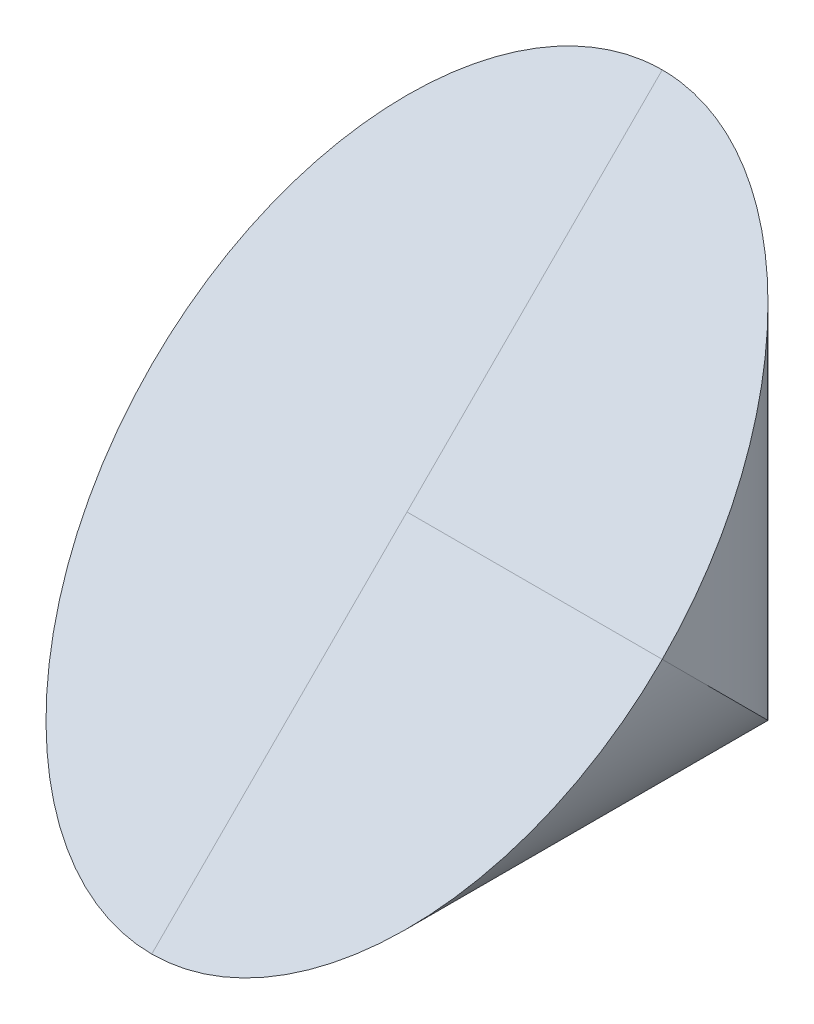
ISO-10303-21;
HEADER;
FILE_DESCRIPTION(('STEP AP214'),'2;1');
FILE_NAME('part.step','',(''),(''),'','','');
FILE_SCHEMA(('AUTOMOTIVE_DESIGN { 1 0 10303 214 1 1 1 1 }'));
ENDSEC;
DATA;
#1=APPLICATION_CONTEXT('core data for automotive mechanical design processes');
#2=APPLICATION_PROTOCOL_DEFINITION('international standard','automotive_design',2000,#1);
#3=PRODUCT_CONTEXT('',#1,'mechanical');
#4=PRODUCT('Part','Part','',(#3));
#5=PRODUCT_RELATED_PRODUCT_CATEGORY('part','',(#4));
#6=PRODUCT_DEFINITION_FORMATION('','',#4);
#7=PRODUCT_DEFINITION_CONTEXT('part definition',#1,'design');
#8=PRODUCT_DEFINITION('design','',#6,#7);
#9=PRODUCT_DEFINITION_SHAPE('','',#8);
#10=(LENGTH_UNIT() NAMED_UNIT(*) SI_UNIT(.MILLI.,.METRE.));
#11=(NAMED_UNIT(*) PLANE_ANGLE_UNIT() SI_UNIT($,.RADIAN.));
#12=(NAMED_UNIT(*) SI_UNIT($,.STERADIAN.) SOLID_ANGLE_UNIT());
#13=UNCERTAINTY_MEASURE_WITH_UNIT(LENGTH_MEASURE(1.E-05),#10,'distance_accuracy_value','');
#14=(GEOMETRIC_REPRESENTATION_CONTEXT(3) GLOBAL_UNCERTAINTY_ASSIGNED_CONTEXT((#13)) GLOBAL_UNIT_ASSIGNED_CONTEXT((#10,
#11,#12)) REPRESENTATION_CONTEXT('',''));
#15=CARTESIAN_POINT('',(0.,0.,0.));
#16=DIRECTION('',(0.,0.,1.));
#17=DIRECTION('',(1.,0.,0.));
#18=AXIS2_PLACEMENT_3D('',#15,#16,#17);
#19=CARTESIAN_POINT('',(60.,30.,0.));
#20=DIRECTION('',(0.,0.707106781186547,0.707106781186547));
#21=DIRECTION('',(0.,-0.707106781186548,0.707106781186548));
#22=AXIS2_PLACEMENT_3D('',#19,#20,#21);
#23=PLANE('',#22);
#24=CARTESIAN_POINT('',(0.,0.,30.));
#25=DIRECTION('',(0.,-0.707106781186547,-0.707106781186547));
#26=DIRECTION('',(0.,0.707106781186547,-0.707106781186547));
#27=AXIS2_PLACEMENT_3D('',#24,#25,#26);
#28=ELLIPSE('',#27,42.4264068711928,30.);
#29=CARTESIAN_POINT('',(-30.,0.,30.));
#30=VERTEX_POINT('',#29);
#31=CARTESIAN_POINT('',(1.96023752785379E-13,-30.,60.));
#32=VERTEX_POINT('',#31);
#33=EDGE_CURVE('E189',#30,#32,#28,.F.);
#34=ORIENTED_EDGE('',*,*,#33,.T.);
#35=DIRECTION('',(0.,-0.707106781186547,0.707106781186548));
#36=VECTOR('',#35,1.);
#37=CARTESIAN_POINT('',(0.,15.,15.));
#38=LINE('',#37,#36);
#39=CARTESIAN_POINT('',(1.04744440006029E-13,0.,30.));
#40=VERTEX_POINT('',#39);
#41=EDGE_CURVE('E179',#40,#32,#38,.T.);
#42=ORIENTED_EDGE('',*,*,#41,.F.);
#43=DIRECTION('',(0.,-0.707106781186547,0.707106781186548));
#44=VECTOR('',#43,1.);
#45=CARTESIAN_POINT('',(0.,15.,15.));
#46=LINE('',#45,#44);
#47=CARTESIAN_POINT('',(0.,29.9999375196154,-1.27916818343411E-05));
#48=VERTEX_POINT('',#47);
#49=EDGE_CURVE('E169',#48,#40,#46,.T.);
#50=ORIENTED_EDGE('',*,*,#49,.F.);
#51=CARTESIAN_POINT('',(0.,0.,30.));
#52=DIRECTION('',(0.,-0.707106781186547,-0.707106781186547));
#53=DIRECTION('',(0.,0.707106781186547,-0.707106781186547));
#54=AXIS2_PLACEMENT_3D('',#51,#52,#53);
#55=ELLIPSE('',#54,42.4264068711928,30.);
#56=EDGE_CURVE('E117',#48,#30,#55,.F.);
#57=ORIENTED_EDGE('',*,*,#56,.T.);
#58=EDGE_LOOP('',(#34,#42,#50,#57));
#59=FACE_BOUND('',#58,.T.);
#60=ADVANCED_FACE('F107',(#59),#23,.T.);
#61=CARTESIAN_POINT('',(0.,60.,30.));
#62=DIRECTION('',(0.,-1.,0.));
#63=DIRECTION('',(0.,0.,-1.));
#64=AXIS2_PLACEMENT_3D('',#61,#62,#63);
#65=CYLINDRICAL_SURFACE('',#64,30.);
#66=CARTESIAN_POINT('',(29.9999999999167,-7.07106781131644E-05,29.9999292893219));
#67=CARTESIAN_POINT('',(29.9999965256696,1.47392746542117,28.5259311132226));
#68=CARTESIAN_POINT('',(29.8555353024132,2.94043876057361,27.0594198180702));
#69=CARTESIAN_POINT('',(29.7110169392927,4.40753011627186,25.5923284623719));
#70=CARTESIAN_POINT('',(29.4235463414365,5.8526289221084,24.1472296565354));
#71=CARTESIAN_POINT('',(29.1359239874639,7.29849059755394,22.7013679810898));
#72=CARTESIAN_POINT('',(28.7081933943547,8.70845387480546,21.2914047038383));
#73=CARTESIAN_POINT('',(28.2802370017013,10.1191614735305,19.8806971051133));
#74=CARTESIAN_POINT('',(27.7163656804415,11.4804105456897,18.5194480329541));
#75=CARTESIAN_POINT('',(27.152196690758,12.8423782230525,17.1574803555912));
#76=CARTESIAN_POINT('',(26.4576150141277,14.141803556765,15.8580550218788));
#77=CARTESIAN_POINT('',(25.7626666668673,15.4419148589124,14.5579437197313));
#78=CARTESIAN_POINT('',(24.9440638160818,16.6670023153263,13.3328562633174));
#79=CARTESIAN_POINT('',(24.1250189812648,17.8927512269166,12.1071073517271));
#80=CARTESIAN_POINT('',(23.1902883680234,19.0316878498389,10.9681707288049));
#81=CARTESIAN_POINT('',(22.2550306889982,20.17126668402,9.82859189462373));
#82=CARTESIAN_POINT('',(21.2131784355817,21.2130870142255,8.78677156441831));
#83=CARTESIAN_POINT('',(20.1707261729825,22.2555073352288,7.74435124341493));
#84=CARTESIAN_POINT('',(19.0317746111084,23.1901918050545,6.80966677358927));
#85=CARTESIAN_POINT('',(17.8921534258781,24.1254258035631,5.87443277508069));
#86=CARTESIAN_POINT('',(16.667084942914,24.9439616794909,5.05589689915292));
#87=CARTESIAN_POINT('',(15.4412668710249,25.7629983971559,4.23686018148786));
#88=CARTESIAN_POINT('',(14.1418826168853,26.4575069255819,3.54235165306187));
#89=CARTESIAN_POINT('',(12.8416720365082,27.1524571175245,2.84740146111923));
#90=CARTESIAN_POINT('',(11.4804866389136,27.7162513189288,2.28360725971495));
#91=CARTESIAN_POINT('',(10.1184030175681,28.2804175588102,1.71944101983358));
#92=CARTESIAN_POINT('',(8.70852763027676,28.7080724992747,1.29178607936909));
#93=CARTESIAN_POINT('',(7.29770491552174,29.1360147908581,0.863843787785685));
#94=CARTESIAN_POINT('',(5.85270099148456,29.4234187151105,0.576439863533243));
#95=CARTESIAN_POINT('',(4.40670876261929,29.711019208162,0.288839370481766));
#96=CARTESIAN_POINT('',(2.94050981175012,29.855400811988,0.144457766655766));
#97=CARTESIAN_POINT('',(1.47353742535909,29.9998585786438,0.));
#98=CARTESIAN_POINT('',(0.,29.9998585786438,0.));
#99=B_SPLINE_CURVE_WITH_KNOTS('',2,(#66,#67,#68,#69,#70,#71,#72,#73,#74,#75,#76,#77,#78,#79,#80,
#81,#82,#83,#84,#85,#86,#87,#88,#89,#90,#91,#92,#93,#94,#95,#96,#97,#98),.UNSPECIFIED.,.F.,.F.,
(3,2,2,2,2,2,2,2,2,2,2,2,2,2,2,2,3),(0.,0.0625,0.125,0.1875,0.25,0.3125,0.375,0.4375,0.5,0.5625,
0.625,0.6875,0.75,0.8125,0.875,0.9375,1.),.UNSPECIFIED.);
#100=CARTESIAN_POINT('',(29.9999999999644,1.6104312189899E-05,30.0000366881727));
#101=VERTEX_POINT('',#100);
#102=EDGE_CURVE('E12',#101,#48,#99,.T.);
#103=ORIENTED_EDGE('',*,*,#102,.F.);
#104=CARTESIAN_POINT('',(0.,0.,30.));
#105=DIRECTION('',(0.,0.707106781186547,-0.707106781186547));
#106=DIRECTION('',(0.,-0.707106781186547,-0.707106781186547));
#107=AXIS2_PLACEMENT_3D('',#104,#105,#106);
#108=ELLIPSE('',#107,42.4264068711928,30.);
#109=EDGE_CURVE('E237',#30,#101,#108,.F.);
#110=ORIENTED_EDGE('',*,*,#109,.F.);
#111=ORIENTED_EDGE('',*,*,#56,.F.);
#112=EDGE_LOOP('',(#103,#110,#111));
#113=FACE_BOUND('',#112,.T.);
#114=ADVANCED_FACE('F227',(#113),#65,.T.);
#115=CARTESIAN_POINT('',(0.,0.,60.));
#116=DIRECTION('',(0.,0.,-1.));
#117=DIRECTION('',(-1.,0.,0.));
#118=AXIS2_PLACEMENT_3D('',#115,#116,#117);
#119=CYLINDRICAL_SURFACE('',#118,30.);
#120=ORIENTED_EDGE('',*,*,#109,.T.);
#121=CARTESIAN_POINT('',(0.,0.,30.));
#122=DIRECTION('',(0.,0.707106781186547,0.707106781186547));
#123=DIRECTION('',(0.,0.707106781186547,-0.707106781186547));
#124=AXIS2_PLACEMENT_3D('',#121,#122,#123);
#125=ELLIPSE('',#124,42.4264068711928,30.);
#126=EDGE_CURVE('E180',#32,#101,#125,.T.);
#127=ORIENTED_EDGE('',*,*,#126,.F.);
#128=ORIENTED_EDGE('',*,*,#33,.F.);
#129=EDGE_LOOP('',(#120,#127,#128));
#130=FACE_BOUND('',#129,.T.);
#131=ADVANCED_FACE('F109',(#130),#119,.T.);
#132=CARTESIAN_POINT('',(0.,14.9999292893219,14.9999292893219));
#133=DIRECTION('',(0.,0.707106781186548,0.707106781186547));
#134=DIRECTION('',(0.,-0.707106781186547,0.707106781186548));
#135=AXIS2_PLACEMENT_3D('',#132,#133,#134);
#136=PLANE('',#135);
#137=ORIENTED_EDGE('',*,*,#102,.T.);
#138=DIRECTION('',(0.,-0.707106781186547,0.707106781186548));
#139=VECTOR('',#138,1.);
#140=CARTESIAN_POINT('',(0.,14.9999292893219,14.9999292893219));
#141=LINE('',#140,#139);
#142=CARTESIAN_POINT('',(1.04744440165294E-13,-7.07106781065117E-05,29.9999292893219));
#143=VERTEX_POINT('',#142);
#144=EDGE_CURVE('E191',#48,#143,#141,.T.);
#145=ORIENTED_EDGE('',*,*,#144,.T.);
#146=DIRECTION('',(1.,0.,0.));
#147=VECTOR('',#146,1.);
#148=CARTESIAN_POINT('',(0.,-7.07106781013075E-05,29.9999292893219));
#149=LINE('',#148,#147);
#150=EDGE_CURVE('E190',#143,#101,#149,.T.);
#151=ORIENTED_EDGE('',*,*,#150,.T.);
#152=EDGE_LOOP('',(#137,#145,#151));
#153=FACE_BOUND('',#152,.T.);
#154=ADVANCED_FACE('F208',(#153),#136,.T.);
#155=CARTESIAN_POINT('',(0.,14.9999292893219,14.9999292893219));
#156=DIRECTION('',(-1.,0.,0.));
#157=DIRECTION('',(0.,0.,1.));
#158=AXIS2_PLACEMENT_3D('',#155,#156,#157);
#159=PLANE('',#158);
#160=ORIENTED_EDGE('',*,*,#49,.T.);
#161=DIRECTION('',(0.,0.707106781186548,0.707106781186547));
#162=VECTOR('',#161,1.);
#163=CARTESIAN_POINT('',(1.04744440165294E-13,-7.07106781065117E-05,29.9999292893219));
#164=LINE('',#163,#162);
#165=EDGE_CURVE('E166',#143,#40,#164,.T.);
#166=ORIENTED_EDGE('',*,*,#165,.F.);
#167=ORIENTED_EDGE('',*,*,#144,.F.);
#168=EDGE_LOOP('',(#160,#166,#167));
#169=FACE_BOUND('',#168,.T.);
#170=ADVANCED_FACE('F218',(#169),#159,.F.);
#171=CARTESIAN_POINT('',(0.,-7.07106781013075E-05,29.9999292893219));
#172=DIRECTION('',(0.,-0.707106781186547,0.707106781186548));
#173=DIRECTION('',(0.,-0.707106781186548,-0.707106781186547));
#174=AXIS2_PLACEMENT_3D('',#171,#172,#173);
#175=PLANE('',#174);
#176=ORIENTED_EDGE('',*,*,#165,.T.);
#177=DIRECTION('',(0.,-0.707106781186548,-0.707106781186547));
#178=VECTOR('',#177,1.);
#179=CARTESIAN_POINT('',(1.04744440006029E-13,7.0710678136002E-05,30.0000707106781));
#180=LINE('',#179,#178);
#181=CARTESIAN_POINT('',(1.04744440006029E-13,7.0710678136002E-05,30.0000707106781));
#182=VERTEX_POINT('',#181);
#183=EDGE_CURVE('E164',#182,#40,#180,.T.);
#184=ORIENTED_EDGE('',*,*,#183,.F.);
#185=DIRECTION('',(-1.,0.,0.));
#186=VECTOR('',#185,1.);
#187=CARTESIAN_POINT('',(0.,7.0710678136002E-05,30.0000707106781));
#188=LINE('',#187,#186);
#189=EDGE_CURVE('E151',#101,#182,#188,.T.);
#190=ORIENTED_EDGE('',*,*,#189,.F.);
#191=ORIENTED_EDGE('',*,*,#150,.F.);
#192=EDGE_LOOP('',(#176,#184,#190,#191));
#193=FACE_BOUND('',#192,.T.);
#194=ADVANCED_FACE('F165',(#193),#175,.F.);
#195=CARTESIAN_POINT('',(0.,7.07106781186548E-05,30.0000707106781));
#196=DIRECTION('',(0.,0.707106781186547,0.707106781186547));
#197=DIRECTION('',(0.,0.707106781186547,-0.707106781186547));
#198=AXIS2_PLACEMENT_3D('',#195,#196,#197);
#199=ELLIPSE('',#198,42.4264068711928,30.);
#200=DIRECTION('',(0.,-0.707106781186548,-0.707106781186547));
#201=VECTOR('',#200,1.);
#202=SURFACE_OF_LINEAR_EXTRUSION('',#199,#201);
#203=ORIENTED_EDGE('',*,*,#126,.T.);
#204=CARTESIAN_POINT('',(1.96023752785379E-13,-29.9999292893219,60.0000707106782));
#205=VERTEX_POINT('',#204);
#206=EDGE_CURVE('E158',#205,#101,#199,.T.);
#207=ORIENTED_EDGE('',*,*,#206,.F.);
#208=DIRECTION('',(0.,-0.707106781186548,-0.707106781186547));
#209=VECTOR('',#208,1.);
#210=CARTESIAN_POINT('',(1.96023752785379E-13,-29.9999292893219,60.0000707106782));
#211=LINE('',#210,#209);
#212=EDGE_CURVE('E170',#205,#32,#211,.T.);
#213=ORIENTED_EDGE('',*,*,#212,.T.);
#214=EDGE_LOOP('',(#203,#207,#213));
#215=FACE_BOUND('',#214,.T.);
#216=ADVANCED_FACE('F219',(#215),#202,.F.);
#217=CARTESIAN_POINT('',(0.,15.0000707106781,15.0000707106781));
#218=DIRECTION('',(1.,0.,0.));
#219=DIRECTION('',(0.,0.,-1.));
#220=AXIS2_PLACEMENT_3D('',#217,#218,#219);
#221=PLANE('',#220);
#222=ORIENTED_EDGE('',*,*,#41,.T.);
#223=ORIENTED_EDGE('',*,*,#212,.F.);
#224=DIRECTION('',(0.,-0.707106781186547,0.707106781186548));
#225=VECTOR('',#224,1.);
#226=CARTESIAN_POINT('',(0.,15.0000707106781,15.0000707106781));
#227=LINE('',#226,#225);
#228=EDGE_CURVE('E155',#182,#205,#227,.T.);
#229=ORIENTED_EDGE('',*,*,#228,.F.);
#230=ORIENTED_EDGE('',*,*,#183,.T.);
#231=EDGE_LOOP('',(#222,#223,#229,#230));
#232=FACE_BOUND('',#231,.T.);
#233=ADVANCED_FACE('F172',(#232),#221,.F.);
#234=CARTESIAN_POINT('',(0.,15.0000707106781,15.0000707106781));
#235=DIRECTION('',(0.,0.707106781186548,0.707106781186547));
#236=DIRECTION('',(0.,-0.707106781186547,0.707106781186548));
#237=AXIS2_PLACEMENT_3D('',#234,#235,#236);
#238=PLANE('',#237);
#239=ORIENTED_EDGE('',*,*,#206,.T.);
#240=ORIENTED_EDGE('',*,*,#189,.T.);
#241=ORIENTED_EDGE('',*,*,#228,.T.);
#242=EDGE_LOOP('',(#239,#240,#241));
#243=FACE_BOUND('',#242,.T.);
#244=ADVANCED_FACE('F153',(#243),#238,.T.);
#245=CLOSED_SHELL('',(#60,#114,#131,#154,#170,#194,#216,#233,#244));
#246=MANIFOLD_SOLID_BREP('B2',#245);
#247=ADVANCED_BREP_SHAPE_REPRESENTATION('',(#18,#246),#14);
#248=SHAPE_DEFINITION_REPRESENTATION(#9,#247);
ENDSEC;
END-ISO-10303-21;
